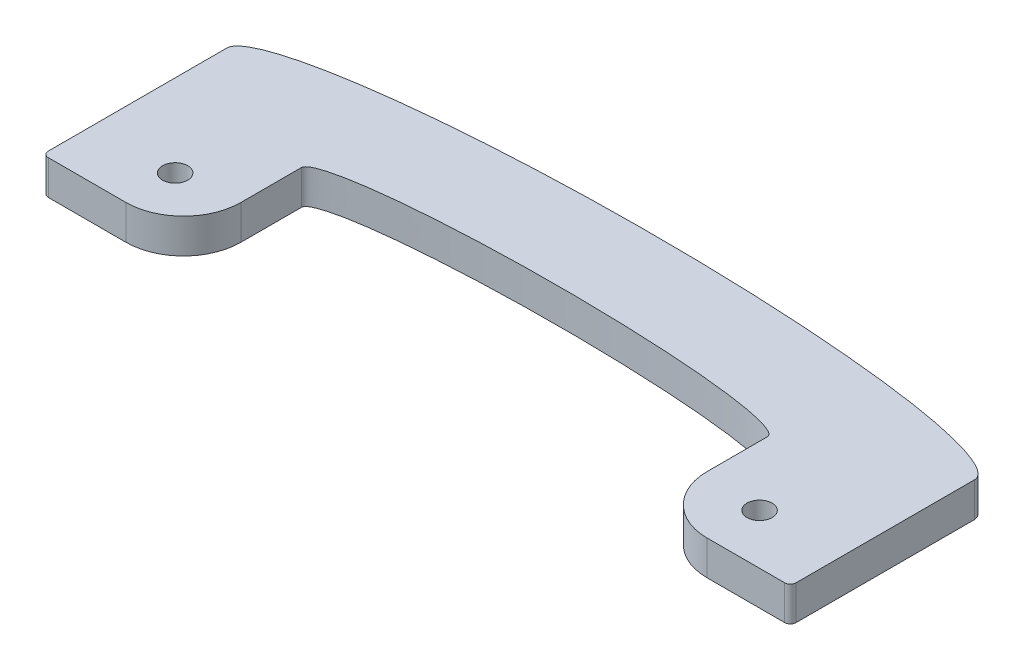
ISO-10303-21;
HEADER;
FILE_DESCRIPTION(('STEP AP214'),'2;1');
FILE_NAME('part.step','',(''),(''),'','','');
FILE_SCHEMA(('AUTOMOTIVE_DESIGN { 1 0 10303 214 1 1 1 1 }'));
ENDSEC;
DATA;
#1=APPLICATION_CONTEXT('core data for automotive mechanical design processes');
#2=APPLICATION_PROTOCOL_DEFINITION('international standard','automotive_design',2000,#1);
#3=PRODUCT_CONTEXT('',#1,'mechanical');
#4=PRODUCT('Part','Part','',(#3));
#5=PRODUCT_RELATED_PRODUCT_CATEGORY('part','',(#4));
#6=PRODUCT_DEFINITION_FORMATION('','',#4);
#7=PRODUCT_DEFINITION_CONTEXT('part definition',#1,'design');
#8=PRODUCT_DEFINITION('design','',#6,#7);
#9=PRODUCT_DEFINITION_SHAPE('','',#8);
#10=(LENGTH_UNIT() NAMED_UNIT(*) SI_UNIT(.MILLI.,.METRE.));
#11=(NAMED_UNIT(*) PLANE_ANGLE_UNIT() SI_UNIT($,.RADIAN.));
#12=(NAMED_UNIT(*) SI_UNIT($,.STERADIAN.) SOLID_ANGLE_UNIT());
#13=UNCERTAINTY_MEASURE_WITH_UNIT(LENGTH_MEASURE(1.E-05),#10,'distance_accuracy_value','');
#14=(GEOMETRIC_REPRESENTATION_CONTEXT(3) GLOBAL_UNCERTAINTY_ASSIGNED_CONTEXT((#13)) GLOBAL_UNIT_ASSIGNED_CONTEXT((#10,
#11,#12)) REPRESENTATION_CONTEXT('',''));
#15=CARTESIAN_POINT('',(0.,0.,0.));
#16=DIRECTION('',(0.,0.,1.));
#17=DIRECTION('',(1.,0.,0.));
#18=AXIS2_PLACEMENT_3D('',#15,#16,#17);
#19=CARTESIAN_POINT('',(0.,3.,0.));
#20=DIRECTION('',(0.,0.,-1.));
#21=DIRECTION('',(-1.,0.,0.));
#22=AXIS2_PLACEMENT_3D('',#19,#20,#21);
#23=PLANE('',#22);
#24=DIRECTION('',(1.,0.,0.));
#25=VECTOR('',#24,1.);
#26=CARTESIAN_POINT('',(0.,0.,0.));
#27=LINE('',#26,#25);
#28=CARTESIAN_POINT('',(25.2600000000002,0.,0.));
#29=VERTEX_POINT('',#28);
#30=CARTESIAN_POINT('',(32.,0.,0.));
#31=VERTEX_POINT('',#30);
#32=EDGE_CURVE('E209',#29,#31,#27,.T.);
#33=ORIENTED_EDGE('',*,*,#32,.T.);
#34=DIRECTION('',(0.,-1.,0.));
#35=VECTOR('',#34,1.);
#36=CARTESIAN_POINT('',(32.,3.,0.));
#37=LINE('',#36,#35);
#38=CARTESIAN_POINT('',(32.,3.,0.));
#39=VERTEX_POINT('',#38);
#40=EDGE_CURVE('E237',#31,#39,#37,.F.);
#41=ORIENTED_EDGE('',*,*,#40,.T.);
#42=DIRECTION('',(1.,0.,0.));
#43=VECTOR('',#42,1.);
#44=CARTESIAN_POINT('',(0.,3.,0.));
#45=LINE('',#44,#43);
#46=CARTESIAN_POINT('',(25.2600000000002,3.,0.));
#47=VERTEX_POINT('',#46);
#48=EDGE_CURVE('E201',#47,#39,#45,.T.);
#49=ORIENTED_EDGE('',*,*,#48,.F.);
#50=DIRECTION('',(0.,1.,0.));
#51=VECTOR('',#50,1.);
#52=CARTESIAN_POINT('',(25.2600000000002,0.,0.));
#53=LINE('',#52,#51);
#54=EDGE_CURVE('E228',#47,#29,#53,.F.);
#55=ORIENTED_EDGE('',*,*,#54,.T.);
#56=EDGE_LOOP('',(#33,#41,#49,#55));
#57=FACE_BOUND('',#56,.T.);
#58=ADVANCED_FACE('F35',(#57),#23,.F.);
#59=CARTESIAN_POINT('',(0.,3.,-16.));
#60=DIRECTION('',(0.,1.,0.));
#61=DIRECTION('',(-1.,0.,0.));
#62=AXIS2_PLACEMENT_3D('',#59,#60,#61);
#63=ELLIPSE('',#62,32.5,4.5);
#64=DIRECTION('',(0.,-1.,0.));
#65=VECTOR('',#64,1.);
#66=SURFACE_OF_LINEAR_EXTRUSION('',#63,#65);
#67=CARTESIAN_POINT('',(0.,0.,-16.));
#68=DIRECTION('',(0.,1.,0.));
#69=DIRECTION('',(-1.,0.,0.));
#70=AXIS2_PLACEMENT_3D('',#67,#68,#69);
#71=ELLIPSE('',#70,32.5,4.5);
#72=CARTESIAN_POINT('',(32.5,0.,-16.));
#73=VERTEX_POINT('',#72);
#74=CARTESIAN_POINT('',(-32.5,0.,-16.));
#75=VERTEX_POINT('',#74);
#76=EDGE_CURVE('E205',#73,#75,#71,.T.);
#77=ORIENTED_EDGE('',*,*,#76,.T.);
#78=DIRECTION('',(0.,-1.,0.));
#79=VECTOR('',#78,1.);
#80=CARTESIAN_POINT('',(-32.5,3.,-16.));
#81=LINE('',#80,#79);
#82=CARTESIAN_POINT('',(-32.5,3.,-16.));
#83=VERTEX_POINT('',#82);
#84=EDGE_CURVE('E204',#83,#75,#81,.T.);
#85=ORIENTED_EDGE('',*,*,#84,.F.);
#86=CARTESIAN_POINT('',(32.5,3.,-16.));
#87=VERTEX_POINT('',#86);
#88=EDGE_CURVE('E192',#87,#83,#63,.T.);
#89=ORIENTED_EDGE('',*,*,#88,.F.);
#90=DIRECTION('',(0.,-1.,0.));
#91=VECTOR('',#90,1.);
#92=CARTESIAN_POINT('',(32.5,3.,-16.));
#93=LINE('',#92,#91);
#94=EDGE_CURVE('E198',#87,#73,#93,.T.);
#95=ORIENTED_EDGE('',*,*,#94,.T.);
#96=EDGE_LOOP('',(#77,#85,#89,#95));
#97=FACE_BOUND('',#96,.T.);
#98=ADVANCED_FACE('F185',(#97),#66,.F.);
#99=CARTESIAN_POINT('',(-32.5,3.,0.));
#100=DIRECTION('',(1.,0.,0.));
#101=DIRECTION('',(0.,0.,-1.));
#102=AXIS2_PLACEMENT_3D('',#99,#100,#101);
#103=PLANE('',#102);
#104=DIRECTION('',(0.,0.,1.));
#105=VECTOR('',#104,1.);
#106=CARTESIAN_POINT('',(-32.5,0.,0.));
#107=LINE('',#106,#105);
#108=CARTESIAN_POINT('',(-32.5,0.,-0.499999999999996));
#109=VERTEX_POINT('',#108);
#110=EDGE_CURVE('E207',#75,#109,#107,.T.);
#111=ORIENTED_EDGE('',*,*,#110,.T.);
#112=DIRECTION('',(0.,-1.,0.));
#113=VECTOR('',#112,1.);
#114=CARTESIAN_POINT('',(-32.5,3.,-0.499999999999996));
#115=LINE('',#114,#113);
#116=CARTESIAN_POINT('',(-32.5,3.,-0.499999999999996));
#117=VERTEX_POINT('',#116);
#118=EDGE_CURVE('E11',#109,#117,#115,.F.);
#119=ORIENTED_EDGE('',*,*,#118,.T.);
#120=DIRECTION('',(0.,0.,1.));
#121=VECTOR('',#120,1.);
#122=CARTESIAN_POINT('',(-32.5,3.,0.));
#123=LINE('',#122,#121);
#124=EDGE_CURVE('E196',#83,#117,#123,.T.);
#125=ORIENTED_EDGE('',*,*,#124,.F.);
#126=ORIENTED_EDGE('',*,*,#84,.T.);
#127=EDGE_LOOP('',(#111,#119,#125,#126));
#128=FACE_BOUND('',#127,.T.);
#129=ADVANCED_FACE('F181',(#128),#103,.F.);
#130=CARTESIAN_POINT('',(-32.,3.,0.));
#131=VERTEX_POINT('',#130);
#132=CARTESIAN_POINT('',(-25.2600000000002,3.,0.));
#133=VERTEX_POINT('',#132);
#134=EDGE_CURVE('E202',#131,#133,#45,.T.);
#135=ORIENTED_EDGE('',*,*,#134,.F.);
#136=DIRECTION('',(0.,-1.,0.));
#137=VECTOR('',#136,1.);
#138=CARTESIAN_POINT('',(-32.,3.,0.));
#139=LINE('',#138,#137);
#140=CARTESIAN_POINT('',(-32.,0.,0.));
#141=VERTEX_POINT('',#140);
#142=EDGE_CURVE('E43',#131,#141,#139,.T.);
#143=ORIENTED_EDGE('',*,*,#142,.T.);
#144=CARTESIAN_POINT('',(-25.2600000000002,0.,0.));
#145=VERTEX_POINT('',#144);
#146=EDGE_CURVE('E197',#141,#145,#27,.T.);
#147=ORIENTED_EDGE('',*,*,#146,.T.);
#148=DIRECTION('',(0.,1.,0.));
#149=VECTOR('',#148,1.);
#150=CARTESIAN_POINT('',(-25.2600000000002,3.,0.));
#151=LINE('',#150,#149);
#152=EDGE_CURVE('E213',#145,#133,#151,.T.);
#153=ORIENTED_EDGE('',*,*,#152,.T.);
#154=EDGE_LOOP('',(#135,#143,#147,#153));
#155=FACE_BOUND('',#154,.T.);
#156=ADVANCED_FACE('F174',(#155),#23,.F.);
#157=CARTESIAN_POINT('',(0.,3.,-16.));
#158=DIRECTION('',(0.,1.,0.));
#159=DIRECTION('',(0.,0.,1.));
#160=AXIS2_PLACEMENT_3D('',#157,#158,#159);
#161=PLANE('',#160);
#162=CARTESIAN_POINT('',(-25.34,3.,-4.36150000000003));
#163=DIRECTION('',(0.,-1.,0.));
#164=DIRECTION('',(0.,0.,-1.));
#165=AXIS2_PLACEMENT_3D('',#162,#163,#164);
#166=CIRCLE('',#165,1.0922);
#167=CARTESIAN_POINT('',(-25.34,3.,-5.45370000000003));
#168=VERTEX_POINT('',#167);
#169=EDGE_CURVE('E284',#168,#168,#166,.T.);
#170=ORIENTED_EDGE('',*,*,#169,.T.);
#171=EDGE_LOOP('',(#170));
#172=FACE_BOUND('',#171,.T.);
#173=CARTESIAN_POINT('',(25.46,3.,-4.36150000000003));
#174=DIRECTION('',(0.,-1.,0.));
#175=DIRECTION('',(0.,0.,-1.));
#176=AXIS2_PLACEMENT_3D('',#173,#174,#175);
#177=CIRCLE('',#176,1.0922);
#178=CARTESIAN_POINT('',(25.46,3.,-5.45370000000003));
#179=VERTEX_POINT('',#178);
#180=EDGE_CURVE('E277',#179,#179,#177,.T.);
#181=ORIENTED_EDGE('',*,*,#180,.T.);
#182=EDGE_LOOP('',(#181));
#183=FACE_BOUND('',#182,.T.);
#184=ORIENTED_EDGE('',*,*,#48,.T.);
#185=CARTESIAN_POINT('',(32.,3.,-0.500000000000004));
#186=DIRECTION('',(0.,1.,0.));
#187=DIRECTION('',(0.,0.,1.));
#188=AXIS2_PLACEMENT_3D('',#185,#186,#187);
#189=CIRCLE('',#188,0.5);
#190=CARTESIAN_POINT('',(32.5,3.,-0.500000000000004));
#191=VERTEX_POINT('',#190);
#192=EDGE_CURVE('E240',#39,#191,#189,.T.);
#193=ORIENTED_EDGE('',*,*,#192,.T.);
#194=DIRECTION('',(0.,0.,1.));
#195=VECTOR('',#194,1.);
#196=CARTESIAN_POINT('',(32.5,3.,0.));
#197=LINE('',#196,#195);
#198=EDGE_CURVE('E255',#87,#191,#197,.T.);
#199=ORIENTED_EDGE('',*,*,#198,.F.);
#200=ORIENTED_EDGE('',*,*,#88,.T.);
#201=ORIENTED_EDGE('',*,*,#124,.T.);
#202=CARTESIAN_POINT('',(-32.,3.,-0.499999999999996));
#203=DIRECTION('',(0.,1.,0.));
#204=DIRECTION('',(0.,0.,1.));
#205=AXIS2_PLACEMENT_3D('',#202,#203,#204);
#206=CIRCLE('',#205,0.5);
#207=EDGE_CURVE('E55',#117,#131,#206,.T.);
#208=ORIENTED_EDGE('',*,*,#207,.T.);
#209=ORIENTED_EDGE('',*,*,#134,.T.);
#210=CARTESIAN_POINT('',(-25.2600000000002,3.,-5.));
#211=DIRECTION('',(0.,1.,0.));
#212=DIRECTION('',(0.,0.,1.));
#213=AXIS2_PLACEMENT_3D('',#210,#211,#212);
#214=CIRCLE('',#213,5.);
#215=CARTESIAN_POINT('',(-20.2600000000002,3.,-5.00000000000016));
#216=VERTEX_POINT('',#215);
#217=EDGE_CURVE('E218',#133,#216,#214,.T.);
#218=ORIENTED_EDGE('',*,*,#217,.T.);
#219=DIRECTION('',(0.,0.,1.));
#220=VECTOR('',#219,1.);
#221=CARTESIAN_POINT('',(-20.26,3.,6.72050491138035E-13));
#222=LINE('',#221,#220);
#223=CARTESIAN_POINT('',(-20.2600000000003,3.,-10.25));
#224=VERTEX_POINT('',#223);
#225=EDGE_CURVE('E152',#224,#216,#222,.T.);
#226=ORIENTED_EDGE('',*,*,#225,.F.);
#227=CARTESIAN_POINT('',(-3.4038624409625E-13,3.,-10.25));
#228=DIRECTION('',(0.,1.,0.));
#229=DIRECTION('',(-1.,0.,0.));
#230=AXIS2_PLACEMENT_3D('',#227,#228,#229);
#231=ELLIPSE('',#230,20.26,2.25);
#232=CARTESIAN_POINT('',(20.2600000000003,3.,-10.25));
#233=VERTEX_POINT('',#232);
#234=EDGE_CURVE('E130',#233,#224,#231,.T.);
#235=ORIENTED_EDGE('',*,*,#234,.F.);
#236=DIRECTION('',(0.,0.,1.));
#237=VECTOR('',#236,1.);
#238=CARTESIAN_POINT('',(20.26,3.,6.72050491138035E-13));
#239=LINE('',#238,#237);
#240=CARTESIAN_POINT('',(20.2600000000002,3.,-5.00000000000017));
#241=VERTEX_POINT('',#240);
#242=EDGE_CURVE('E251',#233,#241,#239,.T.);
#243=ORIENTED_EDGE('',*,*,#242,.T.);
#244=CARTESIAN_POINT('',(25.2600000000002,3.,-5.));
#245=DIRECTION('',(0.,1.,0.));
#246=DIRECTION('',(0.,0.,1.));
#247=AXIS2_PLACEMENT_3D('',#244,#245,#246);
#248=CIRCLE('',#247,5.);
#249=EDGE_CURVE('E216',#241,#47,#248,.T.);
#250=ORIENTED_EDGE('',*,*,#249,.T.);
#251=EDGE_LOOP('',(#184,#193,#199,#200,#201,#208,#209,#218,#226,#235,#243,#250));
#252=FACE_BOUND('',#251,.T.);
#253=ADVANCED_FACE('F171',(#172,#183,#252),#161,.T.);
#254=CARTESIAN_POINT('',(0.,0.,-16.));
#255=DIRECTION('',(0.,1.,0.));
#256=DIRECTION('',(0.,0.,1.));
#257=AXIS2_PLACEMENT_3D('',#254,#255,#256);
#258=PLANE('',#257);
#259=CARTESIAN_POINT('',(-25.34,0.,-4.36150000000003));
#260=DIRECTION('',(0.,-1.,0.));
#261=DIRECTION('',(0.,0.,-1.));
#262=AXIS2_PLACEMENT_3D('',#259,#260,#261);
#263=CIRCLE('',#262,1.0922);
#264=CARTESIAN_POINT('',(-25.34,0.,-5.45370000000003));
#265=VERTEX_POINT('',#264);
#266=EDGE_CURVE('E286',#265,#265,#263,.T.);
#267=ORIENTED_EDGE('',*,*,#266,.F.);
#268=EDGE_LOOP('',(#267));
#269=FACE_BOUND('',#268,.T.);
#270=CARTESIAN_POINT('',(25.46,0.,-4.36150000000003));
#271=DIRECTION('',(0.,-1.,0.));
#272=DIRECTION('',(0.,0.,-1.));
#273=AXIS2_PLACEMENT_3D('',#270,#271,#272);
#274=CIRCLE('',#273,1.0922);
#275=CARTESIAN_POINT('',(25.46,0.,-5.45370000000003));
#276=VERTEX_POINT('',#275);
#277=EDGE_CURVE('E279',#276,#276,#274,.T.);
#278=ORIENTED_EDGE('',*,*,#277,.F.);
#279=EDGE_LOOP('',(#278));
#280=FACE_BOUND('',#279,.T.);
#281=DIRECTION('',(0.,0.,1.));
#282=VECTOR('',#281,1.);
#283=CARTESIAN_POINT('',(32.5,0.,0.));
#284=LINE('',#283,#282);
#285=CARTESIAN_POINT('',(32.5,0.,-0.500000000000004));
#286=VERTEX_POINT('',#285);
#287=EDGE_CURVE('E134',#73,#286,#284,.T.);
#288=ORIENTED_EDGE('',*,*,#287,.T.);
#289=CARTESIAN_POINT('',(32.,0.,-0.500000000000004));
#290=DIRECTION('',(0.,1.,0.));
#291=DIRECTION('',(0.,0.,1.));
#292=AXIS2_PLACEMENT_3D('',#289,#290,#291);
#293=CIRCLE('',#292,0.5);
#294=EDGE_CURVE('E235',#286,#31,#293,.F.);
#295=ORIENTED_EDGE('',*,*,#294,.T.);
#296=ORIENTED_EDGE('',*,*,#32,.F.);
#297=CARTESIAN_POINT('',(25.2600000000002,0.,-5.));
#298=DIRECTION('',(0.,1.,0.));
#299=DIRECTION('',(0.,0.,1.));
#300=AXIS2_PLACEMENT_3D('',#297,#298,#299);
#301=CIRCLE('',#300,5.);
#302=CARTESIAN_POINT('',(20.2600000000002,0.,-5.00000000000017));
#303=VERTEX_POINT('',#302);
#304=EDGE_CURVE('E221',#29,#303,#301,.F.);
#305=ORIENTED_EDGE('',*,*,#304,.T.);
#306=DIRECTION('',(0.,0.,1.));
#307=VECTOR('',#306,1.);
#308=CARTESIAN_POINT('',(20.26,0.,6.72050491138035E-13));
#309=LINE('',#308,#307);
#310=CARTESIAN_POINT('',(20.2600000000003,0.,-10.25));
#311=VERTEX_POINT('',#310);
#312=EDGE_CURVE('E150',#311,#303,#309,.T.);
#313=ORIENTED_EDGE('',*,*,#312,.F.);
#314=CARTESIAN_POINT('',(-3.4038624409625E-13,0.,-10.25));
#315=DIRECTION('',(0.,1.,0.));
#316=DIRECTION('',(-1.,0.,0.));
#317=AXIS2_PLACEMENT_3D('',#314,#315,#316);
#318=ELLIPSE('',#317,20.26,2.25);
#319=CARTESIAN_POINT('',(-20.2600000000003,0.,-10.25));
#320=VERTEX_POINT('',#319);
#321=EDGE_CURVE('E127',#311,#320,#318,.T.);
#322=ORIENTED_EDGE('',*,*,#321,.T.);
#323=DIRECTION('',(0.,0.,1.));
#324=VECTOR('',#323,1.);
#325=CARTESIAN_POINT('',(-20.26,0.,6.72050491138035E-13));
#326=LINE('',#325,#324);
#327=CARTESIAN_POINT('',(-20.2600000000002,0.,-5.00000000000016));
#328=VERTEX_POINT('',#327);
#329=EDGE_CURVE('E138',#320,#328,#326,.T.);
#330=ORIENTED_EDGE('',*,*,#329,.T.);
#331=CARTESIAN_POINT('',(-25.2600000000002,0.,-5.));
#332=DIRECTION('',(0.,1.,0.));
#333=DIRECTION('',(0.,0.,1.));
#334=AXIS2_PLACEMENT_3D('',#331,#332,#333);
#335=CIRCLE('',#334,5.);
#336=EDGE_CURVE('E223',#328,#145,#335,.F.);
#337=ORIENTED_EDGE('',*,*,#336,.T.);
#338=ORIENTED_EDGE('',*,*,#146,.F.);
#339=CARTESIAN_POINT('',(-32.,0.,-0.499999999999996));
#340=DIRECTION('',(0.,1.,0.));
#341=DIRECTION('',(0.,0.,1.));
#342=AXIS2_PLACEMENT_3D('',#339,#340,#341);
#343=CIRCLE('',#342,0.5);
#344=EDGE_CURVE('E233',#141,#109,#343,.F.);
#345=ORIENTED_EDGE('',*,*,#344,.T.);
#346=ORIENTED_EDGE('',*,*,#110,.F.);
#347=ORIENTED_EDGE('',*,*,#76,.F.);
#348=EDGE_LOOP('',(#288,#295,#296,#305,#313,#322,#330,#337,#338,#345,#346,#347));
#349=FACE_BOUND('',#348,.T.);
#350=ADVANCED_FACE('F148',(#269,#280,#349),#258,.F.);
#351=CARTESIAN_POINT('',(32.5,3.,0.));
#352=DIRECTION('',(1.,0.,0.));
#353=DIRECTION('',(0.,0.,-1.));
#354=AXIS2_PLACEMENT_3D('',#351,#352,#353);
#355=PLANE('',#354);
#356=ORIENTED_EDGE('',*,*,#198,.T.);
#357=DIRECTION('',(0.,-1.,0.));
#358=VECTOR('',#357,1.);
#359=CARTESIAN_POINT('',(32.5,0.,-0.500000000000004));
#360=LINE('',#359,#358);
#361=EDGE_CURVE('E230',#191,#286,#360,.T.);
#362=ORIENTED_EDGE('',*,*,#361,.T.);
#363=ORIENTED_EDGE('',*,*,#287,.F.);
#364=ORIENTED_EDGE('',*,*,#94,.F.);
#365=EDGE_LOOP('',(#356,#362,#363,#364));
#366=FACE_BOUND('',#365,.T.);
#367=ADVANCED_FACE('F167',(#366),#355,.T.);
#368=CARTESIAN_POINT('',(-20.26,0.,6.72050491138035E-13));
#369=DIRECTION('',(-1.,0.,0.));
#370=DIRECTION('',(0.,0.,1.));
#371=AXIS2_PLACEMENT_3D('',#368,#369,#370);
#372=PLANE('',#371);
#373=ORIENTED_EDGE('',*,*,#225,.T.);
#374=DIRECTION('',(0.,1.,0.));
#375=VECTOR('',#374,1.);
#376=CARTESIAN_POINT('',(-20.2600000000002,0.,-5.00000000000016));
#377=LINE('',#376,#375);
#378=EDGE_CURVE('E141',#216,#328,#377,.F.);
#379=ORIENTED_EDGE('',*,*,#378,.T.);
#380=ORIENTED_EDGE('',*,*,#329,.F.);
#381=DIRECTION('',(0.,1.,0.));
#382=VECTOR('',#381,1.);
#383=CARTESIAN_POINT('',(-20.2600000000003,0.,-10.25));
#384=LINE('',#383,#382);
#385=EDGE_CURVE('E123',#320,#224,#384,.T.);
#386=ORIENTED_EDGE('',*,*,#385,.T.);
#387=EDGE_LOOP('',(#373,#379,#380,#386));
#388=FACE_BOUND('',#387,.T.);
#389=ADVANCED_FACE('F139',(#388),#372,.F.);
#390=DIRECTION('',(0.,1.,0.));
#391=VECTOR('',#390,1.);
#392=SURFACE_OF_LINEAR_EXTRUSION('',#318,#391);
#393=ORIENTED_EDGE('',*,*,#234,.T.);
#394=ORIENTED_EDGE('',*,*,#385,.F.);
#395=ORIENTED_EDGE('',*,*,#321,.F.);
#396=DIRECTION('',(0.,1.,0.));
#397=VECTOR('',#396,1.);
#398=CARTESIAN_POINT('',(20.2600000000003,0.,-10.25));
#399=LINE('',#398,#397);
#400=EDGE_CURVE('E135',#311,#233,#399,.T.);
#401=ORIENTED_EDGE('',*,*,#400,.T.);
#402=EDGE_LOOP('',(#393,#394,#395,#401));
#403=FACE_BOUND('',#402,.T.);
#404=ADVANCED_FACE('F125',(#403),#392,.F.);
#405=CARTESIAN_POINT('',(20.26,0.,6.72050491138035E-13));
#406=DIRECTION('',(-1.,0.,0.));
#407=DIRECTION('',(0.,0.,1.));
#408=AXIS2_PLACEMENT_3D('',#405,#406,#407);
#409=PLANE('',#408);
#410=ORIENTED_EDGE('',*,*,#312,.T.);
#411=DIRECTION('',(0.,1.,0.));
#412=VECTOR('',#411,1.);
#413=CARTESIAN_POINT('',(20.2600000000002,3.,-5.00000000000017));
#414=LINE('',#413,#412);
#415=EDGE_CURVE('E225',#303,#241,#414,.T.);
#416=ORIENTED_EDGE('',*,*,#415,.T.);
#417=ORIENTED_EDGE('',*,*,#242,.F.);
#418=ORIENTED_EDGE('',*,*,#400,.F.);
#419=EDGE_LOOP('',(#410,#416,#417,#418));
#420=FACE_BOUND('',#419,.T.);
#421=ADVANCED_FACE('F161',(#420),#409,.T.);
#422=CARTESIAN_POINT('',(25.46,3.,-4.36150000000003));
#423=DIRECTION('',(0.,-1.,0.));
#424=DIRECTION('',(0.,0.,-1.));
#425=AXIS2_PLACEMENT_3D('',#422,#423,#424);
#426=CYLINDRICAL_SURFACE('',#425,1.0922);
#427=ORIENTED_EDGE('',*,*,#180,.F.);
#428=EDGE_LOOP('',(#427));
#429=FACE_BOUND('',#428,.T.);
#430=ORIENTED_EDGE('',*,*,#277,.T.);
#431=EDGE_LOOP('',(#430));
#432=FACE_BOUND('',#431,.T.);
#433=ADVANCED_FACE('F165',(#429,#432),#426,.F.);
#434=CARTESIAN_POINT('',(-25.34,3.,-4.36150000000003));
#435=DIRECTION('',(0.,-1.,0.));
#436=DIRECTION('',(0.,0.,-1.));
#437=AXIS2_PLACEMENT_3D('',#434,#435,#436);
#438=CYLINDRICAL_SURFACE('',#437,1.0922);
#439=ORIENTED_EDGE('',*,*,#169,.F.);
#440=EDGE_LOOP('',(#439));
#441=FACE_BOUND('',#440,.T.);
#442=ORIENTED_EDGE('',*,*,#266,.T.);
#443=EDGE_LOOP('',(#442));
#444=FACE_BOUND('',#443,.T.);
#445=ADVANCED_FACE('F292',(#441,#444),#438,.F.);
#446=CARTESIAN_POINT('',(-25.2600000000002,3.,-5.));
#447=DIRECTION('',(0.,1.,0.));
#448=DIRECTION('',(0.,0.,1.));
#449=AXIS2_PLACEMENT_3D('',#446,#447,#448);
#450=CYLINDRICAL_SURFACE('',#449,5.);
#451=ORIENTED_EDGE('',*,*,#336,.F.);
#452=ORIENTED_EDGE('',*,*,#378,.F.);
#453=ORIENTED_EDGE('',*,*,#217,.F.);
#454=ORIENTED_EDGE('',*,*,#152,.F.);
#455=EDGE_LOOP('',(#451,#452,#453,#454));
#456=FACE_BOUND('',#455,.T.);
#457=ADVANCED_FACE('F190',(#456),#450,.T.);
#458=CARTESIAN_POINT('',(25.2600000000002,0.,-5.));
#459=DIRECTION('',(0.,-1.,0.));
#460=DIRECTION('',(0.,0.,-1.));
#461=AXIS2_PLACEMENT_3D('',#458,#459,#460);
#462=CYLINDRICAL_SURFACE('',#461,5.);
#463=ORIENTED_EDGE('',*,*,#304,.F.);
#464=ORIENTED_EDGE('',*,*,#54,.F.);
#465=ORIENTED_EDGE('',*,*,#249,.F.);
#466=ORIENTED_EDGE('',*,*,#415,.F.);
#467=EDGE_LOOP('',(#463,#464,#465,#466));
#468=FACE_BOUND('',#467,.T.);
#469=ADVANCED_FACE('F276',(#468),#462,.T.);
#470=CARTESIAN_POINT('',(32.,3.,-0.500000000000004));
#471=DIRECTION('',(0.,1.,0.));
#472=DIRECTION('',(0.,0.,1.));
#473=AXIS2_PLACEMENT_3D('',#470,#471,#472);
#474=CYLINDRICAL_SURFACE('',#473,0.5);
#475=ORIENTED_EDGE('',*,*,#192,.F.);
#476=ORIENTED_EDGE('',*,*,#40,.F.);
#477=ORIENTED_EDGE('',*,*,#294,.F.);
#478=ORIENTED_EDGE('',*,*,#361,.F.);
#479=EDGE_LOOP('',(#475,#476,#477,#478));
#480=FACE_BOUND('',#479,.T.);
#481=ADVANCED_FACE('F266',(#480),#474,.T.);
#482=CARTESIAN_POINT('',(-32.,3.,-0.499999999999996));
#483=DIRECTION('',(0.,-1.,0.));
#484=DIRECTION('',(0.,0.,-1.));
#485=AXIS2_PLACEMENT_3D('',#482,#483,#484);
#486=CYLINDRICAL_SURFACE('',#485,0.5);
#487=ORIENTED_EDGE('',*,*,#207,.F.);
#488=ORIENTED_EDGE('',*,*,#118,.F.);
#489=ORIENTED_EDGE('',*,*,#344,.F.);
#490=ORIENTED_EDGE('',*,*,#142,.F.);
#491=EDGE_LOOP('',(#487,#488,#489,#490));
#492=FACE_BOUND('',#491,.T.);
#493=ADVANCED_FACE('F37',(#492),#486,.T.);
#494=CLOSED_SHELL('',(#58,#98,#129,#156,#253,#350,#367,#389,#404,#421,#433,#445,#457,#469,#481,#493));
#495=MANIFOLD_SOLID_BREP('B2',#494);
#496=ADVANCED_BREP_SHAPE_REPRESENTATION('',(#18,#495),#14);
#497=SHAPE_DEFINITION_REPRESENTATION(#9,#496);
ENDSEC;
END-ISO-10303-21;
